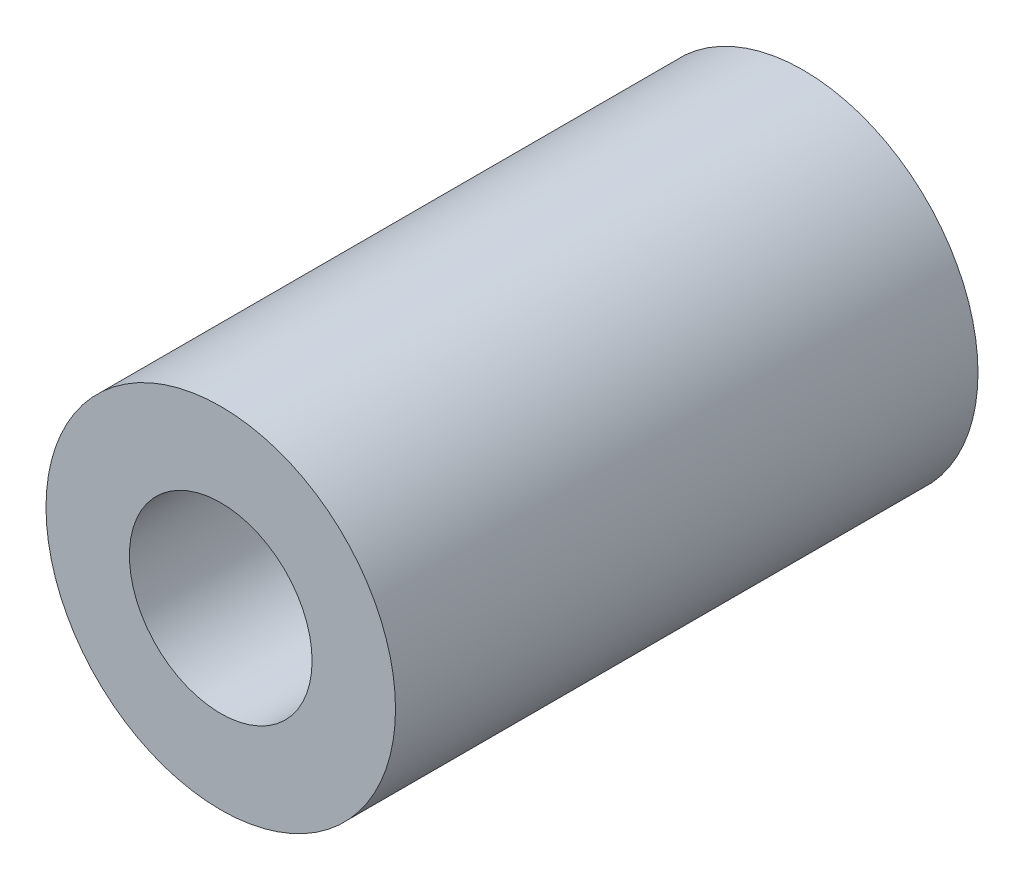
ISO-10303-21;
HEADER;
FILE_DESCRIPTION(('STEP AP214'),'2;1');
FILE_NAME('part.step','',(''),(''),'','','');
FILE_SCHEMA(('AUTOMOTIVE_DESIGN { 1 0 10303 214 1 1 1 1 }'));
ENDSEC;
DATA;
#1=APPLICATION_CONTEXT('core data for automotive mechanical design processes');
#2=APPLICATION_PROTOCOL_DEFINITION('international standard','automotive_design',2000,#1);
#3=PRODUCT_CONTEXT('',#1,'mechanical');
#4=PRODUCT('Part','Part','',(#3));
#5=PRODUCT_RELATED_PRODUCT_CATEGORY('part','',(#4));
#6=PRODUCT_DEFINITION_FORMATION('','',#4);
#7=PRODUCT_DEFINITION_CONTEXT('part definition',#1,'design');
#8=PRODUCT_DEFINITION('design','',#6,#7);
#9=PRODUCT_DEFINITION_SHAPE('','',#8);
#10=(LENGTH_UNIT() NAMED_UNIT(*) SI_UNIT(.MILLI.,.METRE.));
#11=(NAMED_UNIT(*) PLANE_ANGLE_UNIT() SI_UNIT($,.RADIAN.));
#12=(NAMED_UNIT(*) SI_UNIT($,.STERADIAN.) SOLID_ANGLE_UNIT());
#13=UNCERTAINTY_MEASURE_WITH_UNIT(LENGTH_MEASURE(1.E-05),#10,'distance_accuracy_value','');
#14=(GEOMETRIC_REPRESENTATION_CONTEXT(3) GLOBAL_UNCERTAINTY_ASSIGNED_CONTEXT((#13)) GLOBAL_UNIT_ASSIGNED_CONTEXT((#10,
#11,#12)) REPRESENTATION_CONTEXT('',''));
#15=CARTESIAN_POINT('',(0.,0.,0.));
#16=DIRECTION('',(0.,0.,1.));
#17=DIRECTION('',(1.,0.,0.));
#18=AXIS2_PLACEMENT_3D('',#15,#16,#17);
#19=CARTESIAN_POINT('',(0.,0.,7.9375));
#20=DIRECTION('',(0.,0.,-1.));
#21=DIRECTION('',(-1.,0.,0.));
#22=AXIS2_PLACEMENT_3D('',#19,#20,#21);
#23=CYLINDRICAL_SURFACE('',#22,2.4892);
#24=CARTESIAN_POINT('',(0.,0.,7.9375));
#25=DIRECTION('',(0.,0.,1.));
#26=DIRECTION('',(1.,0.,0.));
#27=AXIS2_PLACEMENT_3D('',#24,#25,#26);
#28=CIRCLE('',#27,2.4892);
#29=CARTESIAN_POINT('',(2.4892,0.,7.9375));
#30=VERTEX_POINT('',#29);
#31=EDGE_CURVE('E47',#30,#30,#28,.T.);
#32=ORIENTED_EDGE('',*,*,#31,.T.);
#33=EDGE_LOOP('',(#32));
#34=FACE_BOUND('',#33,.T.);
#35=CARTESIAN_POINT('',(0.,0.,-7.9375));
#36=DIRECTION('',(0.,0.,1.));
#37=DIRECTION('',(1.,0.,0.));
#38=AXIS2_PLACEMENT_3D('',#35,#36,#37);
#39=CIRCLE('',#38,2.4892);
#40=CARTESIAN_POINT('',(2.4892,0.,-7.9375));
#41=VERTEX_POINT('',#40);
#42=EDGE_CURVE('E54',#41,#41,#39,.T.);
#43=ORIENTED_EDGE('',*,*,#42,.F.);
#44=EDGE_LOOP('',(#43));
#45=FACE_BOUND('',#44,.T.);
#46=ADVANCED_FACE('F39',(#34,#45),#23,.F.);
#47=CARTESIAN_POINT('',(0.,0.,7.9375));
#48=DIRECTION('',(0.,0.,-1.));
#49=DIRECTION('',(-1.,0.,0.));
#50=AXIS2_PLACEMENT_3D('',#47,#48,#49);
#51=CYLINDRICAL_SURFACE('',#50,4.7625);
#52=CARTESIAN_POINT('',(0.,0.,7.9375));
#53=DIRECTION('',(0.,0.,1.));
#54=DIRECTION('',(1.,0.,0.));
#55=AXIS2_PLACEMENT_3D('',#52,#53,#54);
#56=CIRCLE('',#55,4.7625);
#57=CARTESIAN_POINT('',(4.7625,0.,7.9375));
#58=VERTEX_POINT('',#57);
#59=EDGE_CURVE('E10',#58,#58,#56,.T.);
#60=ORIENTED_EDGE('',*,*,#59,.F.);
#61=EDGE_LOOP('',(#60));
#62=FACE_BOUND('',#61,.T.);
#63=CARTESIAN_POINT('',(0.,0.,-7.9375));
#64=DIRECTION('',(0.,0.,1.));
#65=DIRECTION('',(1.,0.,0.));
#66=AXIS2_PLACEMENT_3D('',#63,#64,#65);
#67=CIRCLE('',#66,4.7625);
#68=CARTESIAN_POINT('',(4.7625,0.,-7.9375));
#69=VERTEX_POINT('',#68);
#70=EDGE_CURVE('E42',#69,#69,#67,.T.);
#71=ORIENTED_EDGE('',*,*,#70,.T.);
#72=EDGE_LOOP('',(#71));
#73=FACE_BOUND('',#72,.T.);
#74=ADVANCED_FACE('F63',(#62,#73),#51,.T.);
#75=CARTESIAN_POINT('',(0.,0.,7.9375));
#76=DIRECTION('',(0.,0.,1.));
#77=DIRECTION('',(1.,0.,0.));
#78=AXIS2_PLACEMENT_3D('',#75,#76,#77);
#79=PLANE('',#78);
#80=ORIENTED_EDGE('',*,*,#31,.F.);
#81=EDGE_LOOP('',(#80));
#82=FACE_BOUND('',#81,.T.);
#83=ORIENTED_EDGE('',*,*,#59,.T.);
#84=EDGE_LOOP('',(#83));
#85=FACE_BOUND('',#84,.T.);
#86=ADVANCED_FACE('F67',(#82,#85),#79,.T.);
#87=CARTESIAN_POINT('',(0.,0.,-7.9375));
#88=DIRECTION('',(0.,0.,1.));
#89=DIRECTION('',(1.,0.,0.));
#90=AXIS2_PLACEMENT_3D('',#87,#88,#89);
#91=PLANE('',#90);
#92=ORIENTED_EDGE('',*,*,#42,.T.);
#93=EDGE_LOOP('',(#92));
#94=FACE_BOUND('',#93,.T.);
#95=ORIENTED_EDGE('',*,*,#70,.F.);
#96=EDGE_LOOP('',(#95));
#97=FACE_BOUND('',#96,.T.);
#98=ADVANCED_FACE('F65',(#94,#97),#91,.F.);
#99=CLOSED_SHELL('',(#46,#74,#86,#98));
#100=MANIFOLD_SOLID_BREP('B2',#99);
#101=ADVANCED_BREP_SHAPE_REPRESENTATION('',(#18,#100),#14);
#102=SHAPE_DEFINITION_REPRESENTATION(#9,#101);
ENDSEC;
END-ISO-10303-21;
